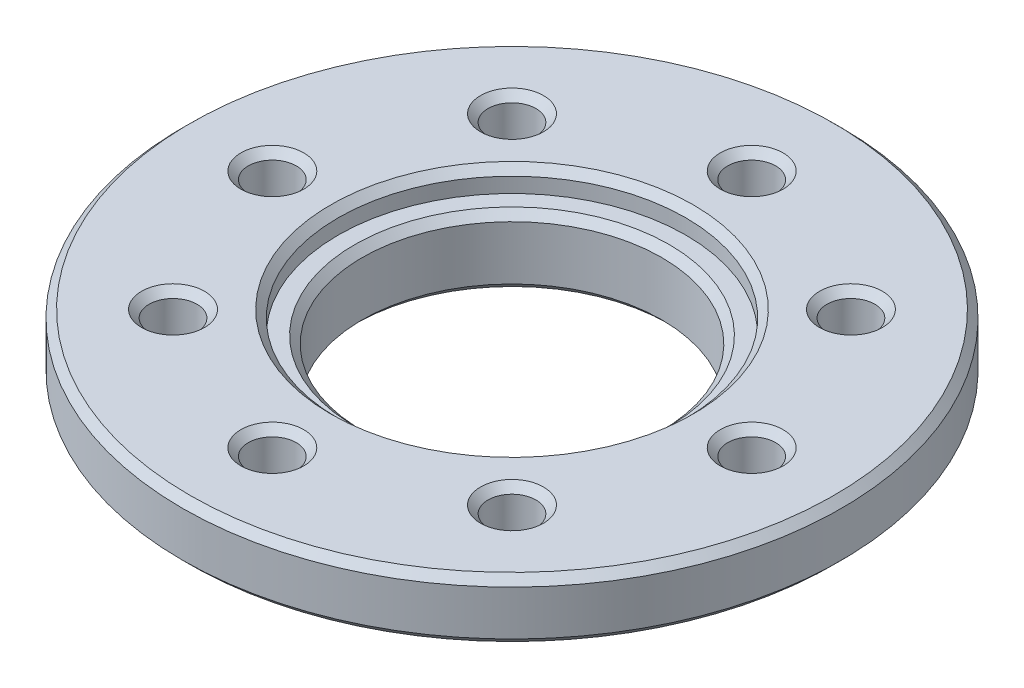
ISO-10303-21;
HEADER;
FILE_DESCRIPTION(('STEP AP214'),'2;1');
FILE_NAME('part.step','',(''),(''),'','','');
FILE_SCHEMA(('AUTOMOTIVE_DESIGN { 1 0 10303 214 1 1 1 1 }'));
ENDSEC;
DATA;
#1=APPLICATION_CONTEXT('core data for automotive mechanical design processes');
#2=APPLICATION_PROTOCOL_DEFINITION('international standard','automotive_design',2000,#1);
#3=PRODUCT_CONTEXT('',#1,'mechanical');
#4=PRODUCT('Part','Part','',(#3));
#5=PRODUCT_RELATED_PRODUCT_CATEGORY('part','',(#4));
#6=PRODUCT_DEFINITION_FORMATION('','',#4);
#7=PRODUCT_DEFINITION_CONTEXT('part definition',#1,'design');
#8=PRODUCT_DEFINITION('design','',#6,#7);
#9=PRODUCT_DEFINITION_SHAPE('','',#8);
#10=(LENGTH_UNIT() NAMED_UNIT(*) SI_UNIT(.MILLI.,.METRE.));
#11=(NAMED_UNIT(*) PLANE_ANGLE_UNIT() SI_UNIT($,.RADIAN.));
#12=(NAMED_UNIT(*) SI_UNIT($,.STERADIAN.) SOLID_ANGLE_UNIT());
#13=UNCERTAINTY_MEASURE_WITH_UNIT(LENGTH_MEASURE(1.E-05),#10,'distance_accuracy_value','');
#14=(GEOMETRIC_REPRESENTATION_CONTEXT(3) GLOBAL_UNCERTAINTY_ASSIGNED_CONTEXT((#13)) GLOBAL_UNIT_ASSIGNED_CONTEXT((#10,
#11,#12)) REPRESENTATION_CONTEXT('',''));
#15=CARTESIAN_POINT('',(0.,0.,0.));
#16=DIRECTION('',(0.,0.,1.));
#17=DIRECTION('',(1.,0.,0.));
#18=AXIS2_PLACEMENT_3D('',#15,#16,#17);
#19=CARTESIAN_POINT('',(0.,-2.,0.));
#20=DIRECTION('',(0.,-1.,0.));
#21=DIRECTION('',(0.,0.,-1.));
#22=AXIS2_PLACEMENT_3D('',#19,#20,#21);
#23=PLANE('',#22);
#24=CARTESIAN_POINT('',(0.,-2.,0.));
#25=DIRECTION('',(0.,-1.,0.));
#26=DIRECTION('',(0.,0.,-1.));
#27=AXIS2_PLACEMENT_3D('',#24,#25,#26);
#28=CIRCLE('',#27,10.7499999999956);
#29=CARTESIAN_POINT('',(0.,-2.,-10.7499999999956));
#30=VERTEX_POINT('',#29);
#31=EDGE_CURVE('E52',#30,#30,#28,.T.);
#32=ORIENTED_EDGE('',*,*,#31,.T.);
#33=EDGE_LOOP('',(#32));
#34=FACE_BOUND('',#33,.T.);
#35=CARTESIAN_POINT('',(0.,-2.,-8.));
#36=DIRECTION('',(0.,-1.,0.));
#37=DIRECTION('',(0.,0.,-1.));
#38=AXIS2_PLACEMENT_3D('',#35,#36,#37);
#39=CIRCLE('',#38,0.799999999999988);
#40=CARTESIAN_POINT('',(0.,-2.,-8.79999999999999));
#41=VERTEX_POINT('',#40);
#42=EDGE_CURVE('E107',#41,#41,#39,.T.);
#43=ORIENTED_EDGE('',*,*,#42,.F.);
#44=EDGE_LOOP('',(#43));
#45=FACE_BOUND('',#44,.T.);
#46=CARTESIAN_POINT('',(5.656854249492,-2.,-5.656854249492));
#47=DIRECTION('',(0.,-1.,0.));
#48=DIRECTION('',(0.,0.,-1.));
#49=AXIS2_PLACEMENT_3D('',#46,#47,#48);
#50=CIRCLE('',#49,0.799999999999988);
#51=CARTESIAN_POINT('',(5.656854249492,-2.,-6.45685424949199));
#52=VERTEX_POINT('',#51);
#53=EDGE_CURVE('E110',#52,#52,#50,.T.);
#54=ORIENTED_EDGE('',*,*,#53,.F.);
#55=EDGE_LOOP('',(#54));
#56=FACE_BOUND('',#55,.T.);
#57=CARTESIAN_POINT('',(8.,-2.,0.));
#58=DIRECTION('',(0.,-1.,0.));
#59=DIRECTION('',(0.,0.,-1.));
#60=AXIS2_PLACEMENT_3D('',#57,#58,#59);
#61=CIRCLE('',#60,0.799999999999988);
#62=CARTESIAN_POINT('',(8.,-2.,-0.799999999999988));
#63=VERTEX_POINT('',#62);
#64=EDGE_CURVE('E129',#63,#63,#61,.T.);
#65=ORIENTED_EDGE('',*,*,#64,.F.);
#66=EDGE_LOOP('',(#65));
#67=FACE_BOUND('',#66,.T.);
#68=CARTESIAN_POINT('',(5.656854249492,-2.,5.656854249492));
#69=DIRECTION('',(0.,-1.,0.));
#70=DIRECTION('',(0.,0.,-1.));
#71=AXIS2_PLACEMENT_3D('',#68,#69,#70);
#72=CIRCLE('',#71,0.799999999999988);
#73=CARTESIAN_POINT('',(5.656854249492,-2.,4.85685424949201));
#74=VERTEX_POINT('',#73);
#75=EDGE_CURVE('E126',#74,#74,#72,.T.);
#76=ORIENTED_EDGE('',*,*,#75,.F.);
#77=EDGE_LOOP('',(#76));
#78=FACE_BOUND('',#77,.T.);
#79=CARTESIAN_POINT('',(0.,-2.,8.));
#80=DIRECTION('',(0.,-1.,0.));
#81=DIRECTION('',(0.,0.,-1.));
#82=AXIS2_PLACEMENT_3D('',#79,#80,#81);
#83=CIRCLE('',#82,0.799999999999988);
#84=CARTESIAN_POINT('',(0.,-2.,7.20000000000001));
#85=VERTEX_POINT('',#84);
#86=EDGE_CURVE('E123',#85,#85,#83,.T.);
#87=ORIENTED_EDGE('',*,*,#86,.F.);
#88=EDGE_LOOP('',(#87));
#89=FACE_BOUND('',#88,.T.);
#90=CARTESIAN_POINT('',(-5.656854249492,-2.,5.656854249492));
#91=DIRECTION('',(0.,-1.,0.));
#92=DIRECTION('',(0.,0.,-1.));
#93=AXIS2_PLACEMENT_3D('',#90,#91,#92);
#94=CIRCLE('',#93,0.799999999999988);
#95=CARTESIAN_POINT('',(-5.656854249492,-2.,4.85685424949201));
#96=VERTEX_POINT('',#95);
#97=EDGE_CURVE('E120',#96,#96,#94,.T.);
#98=ORIENTED_EDGE('',*,*,#97,.F.);
#99=EDGE_LOOP('',(#98));
#100=FACE_BOUND('',#99,.T.);
#101=CARTESIAN_POINT('',(-8.,-2.,0.));
#102=DIRECTION('',(0.,-1.,0.));
#103=DIRECTION('',(0.,0.,-1.));
#104=AXIS2_PLACEMENT_3D('',#101,#102,#103);
#105=CIRCLE('',#104,0.799999999999988);
#106=CARTESIAN_POINT('',(-8.,-2.,-0.799999999999988));
#107=VERTEX_POINT('',#106);
#108=EDGE_CURVE('E117',#107,#107,#105,.T.);
#109=ORIENTED_EDGE('',*,*,#108,.F.);
#110=EDGE_LOOP('',(#109));
#111=FACE_BOUND('',#110,.T.);
#112=CARTESIAN_POINT('',(-5.656854249492,-2.,-5.656854249492));
#113=DIRECTION('',(0.,-1.,0.));
#114=DIRECTION('',(0.,0.,-1.));
#115=AXIS2_PLACEMENT_3D('',#112,#113,#114);
#116=CIRCLE('',#115,0.799999999999988);
#117=CARTESIAN_POINT('',(-5.656854249492,-2.,-6.45685424949199));
#118=VERTEX_POINT('',#117);
#119=EDGE_CURVE('E114',#118,#118,#116,.T.);
#120=ORIENTED_EDGE('',*,*,#119,.F.);
#121=EDGE_LOOP('',(#120));
#122=FACE_BOUND('',#121,.T.);
#123=CARTESIAN_POINT('',(0.,-2.,0.));
#124=DIRECTION('',(0.,-1.,0.));
#125=DIRECTION('',(0.,0.,-1.));
#126=AXIS2_PLACEMENT_3D('',#123,#124,#125);
#127=CIRCLE('',#126,6.25);
#128=CARTESIAN_POINT('',(0.,-2.,-6.25));
#129=VERTEX_POINT('',#128);
#130=EDGE_CURVE('E106',#129,#129,#127,.T.);
#131=ORIENTED_EDGE('',*,*,#130,.F.);
#132=EDGE_LOOP('',(#131));
#133=FACE_BOUND('',#132,.T.);
#134=ADVANCED_FACE('F14',(#34,#45,#56,#67,#78,#89,#100,#111,#122,#133),#23,.T.);
#135=CARTESIAN_POINT('',(0.,0.,0.));
#136=DIRECTION('',(0.,-1.,0.));
#137=DIRECTION('',(0.,0.,-1.));
#138=AXIS2_PLACEMENT_3D('',#135,#136,#137);
#139=CYLINDRICAL_SURFACE('',#138,11.);
#140=CARTESIAN_POINT('',(0.,-1.75000000005246,0.));
#141=DIRECTION('',(0.,-1.,0.));
#142=DIRECTION('',(0.,0.,-1.));
#143=AXIS2_PLACEMENT_3D('',#140,#141,#142);
#144=CIRCLE('',#143,11.);
#145=CARTESIAN_POINT('',(0.,-1.75000000005246,-11.));
#146=VERTEX_POINT('',#145);
#147=EDGE_CURVE('E46',#146,#146,#144,.F.);
#148=ORIENTED_EDGE('',*,*,#147,.T.);
#149=EDGE_LOOP('',(#148));
#150=FACE_BOUND('',#149,.T.);
#151=CARTESIAN_POINT('',(0.,-0.250000000004393,0.));
#152=DIRECTION('',(0.,1.,0.));
#153=DIRECTION('',(0.,0.,1.));
#154=AXIS2_PLACEMENT_3D('',#151,#152,#153);
#155=CIRCLE('',#154,11.);
#156=CARTESIAN_POINT('',(0.,-0.250000000004393,11.));
#157=VERTEX_POINT('',#156);
#158=EDGE_CURVE('E49',#157,#157,#155,.F.);
#159=ORIENTED_EDGE('',*,*,#158,.T.);
#160=EDGE_LOOP('',(#159));
#161=FACE_BOUND('',#160,.T.);
#162=ADVANCED_FACE('F155',(#150,#161),#139,.T.);
#163=CARTESIAN_POINT('',(11.,0.,0.));
#164=DIRECTION('',(0.,1.,0.));
#165=DIRECTION('',(0.,0.,1.));
#166=AXIS2_PLACEMENT_3D('',#163,#164,#165);
#167=PLANE('',#166);
#168=CARTESIAN_POINT('',(8.,0.,0.));
#169=DIRECTION('',(0.,1.,0.));
#170=DIRECTION('',(0.,0.,1.));
#171=AXIS2_PLACEMENT_3D('',#168,#169,#170);
#172=CIRCLE('',#171,1.04999999994754);
#173=CARTESIAN_POINT('',(8.,0.,1.04999999994754));
#174=VERTEX_POINT('',#173);
#175=EDGE_CURVE('E73',#174,#174,#172,.F.);
#176=ORIENTED_EDGE('',*,*,#175,.T.);
#177=EDGE_LOOP('',(#176));
#178=FACE_BOUND('',#177,.T.);
#179=CARTESIAN_POINT('',(-8.,0.,0.));
#180=DIRECTION('',(0.,1.,0.));
#181=DIRECTION('',(0.,0.,1.));
#182=AXIS2_PLACEMENT_3D('',#179,#180,#181);
#183=CIRCLE('',#182,1.04999999994754);
#184=CARTESIAN_POINT('',(-8.,0.,1.04999999994754));
#185=VERTEX_POINT('',#184);
#186=EDGE_CURVE('E76',#185,#185,#183,.F.);
#187=ORIENTED_EDGE('',*,*,#186,.T.);
#188=EDGE_LOOP('',(#187));
#189=FACE_BOUND('',#188,.T.);
#190=CARTESIAN_POINT('',(0.,0.,8.));
#191=DIRECTION('',(0.,1.,0.));
#192=DIRECTION('',(0.,0.,1.));
#193=AXIS2_PLACEMENT_3D('',#190,#191,#192);
#194=CIRCLE('',#193,1.04999999994754);
#195=CARTESIAN_POINT('',(0.,0.,9.04999999994754));
#196=VERTEX_POINT('',#195);
#197=EDGE_CURVE('E79',#196,#196,#194,.F.);
#198=ORIENTED_EDGE('',*,*,#197,.T.);
#199=EDGE_LOOP('',(#198));
#200=FACE_BOUND('',#199,.T.);
#201=CARTESIAN_POINT('',(0.,0.,0.));
#202=DIRECTION('',(0.,1.,0.));
#203=DIRECTION('',(0.,0.,1.));
#204=AXIS2_PLACEMENT_3D('',#201,#202,#203);
#205=CIRCLE('',#204,6.04999999994754);
#206=CARTESIAN_POINT('',(0.,0.,6.04999999994754));
#207=VERTEX_POINT('',#206);
#208=EDGE_CURVE('E82',#207,#207,#205,.F.);
#209=ORIENTED_EDGE('',*,*,#208,.T.);
#210=EDGE_LOOP('',(#209));
#211=FACE_BOUND('',#210,.T.);
#212=CARTESIAN_POINT('',(5.656854249492,0.,5.656854249492));
#213=DIRECTION('',(0.,1.,0.));
#214=DIRECTION('',(0.,0.,1.));
#215=AXIS2_PLACEMENT_3D('',#212,#213,#214);
#216=CIRCLE('',#215,1.04999999994754);
#217=CARTESIAN_POINT('',(5.656854249492,0.,6.70685424943954));
#218=VERTEX_POINT('',#217);
#219=EDGE_CURVE('E85',#218,#218,#216,.F.);
#220=ORIENTED_EDGE('',*,*,#219,.T.);
#221=EDGE_LOOP('',(#220));
#222=FACE_BOUND('',#221,.T.);
#223=CARTESIAN_POINT('',(0.,0.,0.));
#224=DIRECTION('',(0.,1.,0.));
#225=DIRECTION('',(0.,0.,1.));
#226=AXIS2_PLACEMENT_3D('',#223,#224,#225);
#227=CIRCLE('',#226,10.7500000000524);
#228=CARTESIAN_POINT('',(0.,0.,10.7500000000524));
#229=VERTEX_POINT('',#228);
#230=EDGE_CURVE('E88',#229,#229,#227,.T.);
#231=ORIENTED_EDGE('',*,*,#230,.T.);
#232=EDGE_LOOP('',(#231));
#233=FACE_BOUND('',#232,.T.);
#234=CARTESIAN_POINT('',(-5.656854249492,0.,5.656854249492));
#235=DIRECTION('',(0.,1.,0.));
#236=DIRECTION('',(0.,0.,1.));
#237=AXIS2_PLACEMENT_3D('',#234,#235,#236);
#238=CIRCLE('',#237,1.04999999994754);
#239=CARTESIAN_POINT('',(-5.656854249492,0.,6.70685424943954));
#240=VERTEX_POINT('',#239);
#241=EDGE_CURVE('E91',#240,#240,#238,.F.);
#242=ORIENTED_EDGE('',*,*,#241,.T.);
#243=EDGE_LOOP('',(#242));
#244=FACE_BOUND('',#243,.T.);
#245=CARTESIAN_POINT('',(-5.656854249492,0.,-5.656854249492));
#246=DIRECTION('',(0.,1.,0.));
#247=DIRECTION('',(0.,0.,1.));
#248=AXIS2_PLACEMENT_3D('',#245,#246,#247);
#249=CIRCLE('',#248,1.04999999994754);
#250=CARTESIAN_POINT('',(-5.656854249492,0.,-4.60685424954446));
#251=VERTEX_POINT('',#250);
#252=EDGE_CURVE('E94',#251,#251,#249,.F.);
#253=ORIENTED_EDGE('',*,*,#252,.T.);
#254=EDGE_LOOP('',(#253));
#255=FACE_BOUND('',#254,.T.);
#256=CARTESIAN_POINT('',(0.,0.,-8.));
#257=DIRECTION('',(0.,1.,0.));
#258=DIRECTION('',(0.,0.,1.));
#259=AXIS2_PLACEMENT_3D('',#256,#257,#258);
#260=CIRCLE('',#259,1.04999999994754);
#261=CARTESIAN_POINT('',(0.,0.,-6.95000000005246));
#262=VERTEX_POINT('',#261);
#263=EDGE_CURVE('E97',#262,#262,#260,.F.);
#264=ORIENTED_EDGE('',*,*,#263,.T.);
#265=EDGE_LOOP('',(#264));
#266=FACE_BOUND('',#265,.T.);
#267=CARTESIAN_POINT('',(5.656854249492,0.,-5.656854249492));
#268=DIRECTION('',(0.,1.,0.));
#269=DIRECTION('',(0.,0.,1.));
#270=AXIS2_PLACEMENT_3D('',#267,#268,#269);
#271=CIRCLE('',#270,1.04999999994754);
#272=CARTESIAN_POINT('',(5.656854249492,0.,-4.60685424954446));
#273=VERTEX_POINT('',#272);
#274=EDGE_CURVE('E100',#273,#273,#271,.F.);
#275=ORIENTED_EDGE('',*,*,#274,.T.);
#276=EDGE_LOOP('',(#275));
#277=FACE_BOUND('',#276,.T.);
#278=ADVANCED_FACE('F161',(#178,#189,#200,#211,#222,#233,#244,#255,#266,#277),#167,.T.);
#279=CARTESIAN_POINT('',(0.,-3.05,0.));
#280=DIRECTION('',(0.,1.,0.));
#281=DIRECTION('',(0.,0.,1.));
#282=AXIS2_PLACEMENT_3D('',#279,#280,#281);
#283=CYLINDRICAL_SURFACE('',#282,6.25);
#284=CARTESIAN_POINT('',(0.,-2.80000000005244,0.));
#285=DIRECTION('',(0.,-1.,0.));
#286=DIRECTION('',(0.,0.,-1.));
#287=AXIS2_PLACEMENT_3D('',#284,#285,#286);
#288=CIRCLE('',#287,6.25);
#289=CARTESIAN_POINT('',(0.,-2.80000000005244,-6.25));
#290=VERTEX_POINT('',#289);
#291=EDGE_CURVE('E34',#290,#290,#288,.F.);
#292=ORIENTED_EDGE('',*,*,#291,.T.);
#293=EDGE_LOOP('',(#292));
#294=FACE_BOUND('',#293,.T.);
#295=ORIENTED_EDGE('',*,*,#130,.T.);
#296=EDGE_LOOP('',(#295));
#297=FACE_BOUND('',#296,.T.);
#298=ADVANCED_FACE('F167',(#294,#297),#283,.T.);
#299=CARTESIAN_POINT('',(0.,-3.05,0.));
#300=DIRECTION('',(0.,-1.,0.));
#301=DIRECTION('',(0.,0.,-1.));
#302=AXIS2_PLACEMENT_3D('',#299,#300,#301);
#303=PLANE('',#302);
#304=CARTESIAN_POINT('',(0.,-3.05,0.));
#305=DIRECTION('',(0.,-1.,0.));
#306=DIRECTION('',(0.,0.,-1.));
#307=AXIS2_PLACEMENT_3D('',#304,#305,#306);
#308=CIRCLE('',#307,5.25000000000441);
#309=CARTESIAN_POINT('',(0.,-3.05,-5.25000000000441));
#310=VERTEX_POINT('',#309);
#311=EDGE_CURVE('E61',#310,#310,#308,.F.);
#312=ORIENTED_EDGE('',*,*,#311,.T.);
#313=EDGE_LOOP('',(#312));
#314=FACE_BOUND('',#313,.T.);
#315=CARTESIAN_POINT('',(0.,-3.05,0.));
#316=DIRECTION('',(0.,-1.,0.));
#317=DIRECTION('',(0.,0.,-1.));
#318=AXIS2_PLACEMENT_3D('',#315,#316,#317);
#319=CIRCLE('',#318,5.9999999999956);
#320=CARTESIAN_POINT('',(0.,-3.05,-5.9999999999956));
#321=VERTEX_POINT('',#320);
#322=EDGE_CURVE('E64',#321,#321,#319,.T.);
#323=ORIENTED_EDGE('',*,*,#322,.T.);
#324=EDGE_LOOP('',(#323));
#325=FACE_BOUND('',#324,.T.);
#326=ADVANCED_FACE('F259',(#314,#325),#303,.T.);
#327=CARTESIAN_POINT('',(-5.656854249492,0.,-5.656854249492));
#328=DIRECTION('',(0.,1.,0.));
#329=DIRECTION('',(0.,0.,1.));
#330=AXIS2_PLACEMENT_3D('',#327,#328,#329);
#331=CYLINDRICAL_SURFACE('',#330,0.799999999999988);
#332=CARTESIAN_POINT('',(-5.656854249492,-0.250000000004392,-5.656854249492));
#333=DIRECTION('',(0.,1.,0.));
#334=DIRECTION('',(0.,0.,1.));
#335=AXIS2_PLACEMENT_3D('',#332,#333,#334);
#336=CIRCLE('',#335,0.799999999999988);
#337=CARTESIAN_POINT('',(-5.656854249492,-0.250000000004392,-4.85685424949201));
#338=VERTEX_POINT('',#337);
#339=EDGE_CURVE('E29',#338,#338,#336,.T.);
#340=ORIENTED_EDGE('',*,*,#339,.T.);
#341=EDGE_LOOP('',(#340));
#342=FACE_BOUND('',#341,.T.);
#343=ORIENTED_EDGE('',*,*,#119,.T.);
#344=EDGE_LOOP('',(#343));
#345=FACE_BOUND('',#344,.T.);
#346=ADVANCED_FACE('F256',(#342,#345),#331,.F.);
#347=CARTESIAN_POINT('',(-8.,0.,0.));
#348=DIRECTION('',(0.,1.,0.));
#349=DIRECTION('',(0.,0.,1.));
#350=AXIS2_PLACEMENT_3D('',#347,#348,#349);
#351=CYLINDRICAL_SURFACE('',#350,0.799999999999988);
#352=CARTESIAN_POINT('',(-8.,-0.250000000004392,0.));
#353=DIRECTION('',(0.,1.,0.));
#354=DIRECTION('',(0.,0.,1.));
#355=AXIS2_PLACEMENT_3D('',#352,#353,#354);
#356=CIRCLE('',#355,0.799999999999988);
#357=CARTESIAN_POINT('',(-8.,-0.250000000004392,0.799999999999988));
#358=VERTEX_POINT('',#357);
#359=EDGE_CURVE('E70',#358,#358,#356,.T.);
#360=ORIENTED_EDGE('',*,*,#359,.T.);
#361=EDGE_LOOP('',(#360));
#362=FACE_BOUND('',#361,.T.);
#363=ORIENTED_EDGE('',*,*,#108,.T.);
#364=EDGE_LOOP('',(#363));
#365=FACE_BOUND('',#364,.T.);
#366=ADVANCED_FACE('F252',(#362,#365),#351,.F.);
#367=CARTESIAN_POINT('',(-5.656854249492,0.,5.656854249492));
#368=DIRECTION('',(0.,1.,0.));
#369=DIRECTION('',(0.,0.,1.));
#370=AXIS2_PLACEMENT_3D('',#367,#368,#369);
#371=CYLINDRICAL_SURFACE('',#370,0.799999999999988);
#372=CARTESIAN_POINT('',(-5.656854249492,-0.250000000004392,5.656854249492));
#373=DIRECTION('',(0.,1.,0.));
#374=DIRECTION('',(0.,0.,1.));
#375=AXIS2_PLACEMENT_3D('',#372,#373,#374);
#376=CIRCLE('',#375,0.799999999999988);
#377=CARTESIAN_POINT('',(-5.656854249492,-0.250000000004392,6.45685424949199));
#378=VERTEX_POINT('',#377);
#379=EDGE_CURVE('E37',#378,#378,#376,.T.);
#380=ORIENTED_EDGE('',*,*,#379,.T.);
#381=EDGE_LOOP('',(#380));
#382=FACE_BOUND('',#381,.T.);
#383=ORIENTED_EDGE('',*,*,#97,.T.);
#384=EDGE_LOOP('',(#383));
#385=FACE_BOUND('',#384,.T.);
#386=ADVANCED_FACE('F248',(#382,#385),#371,.F.);
#387=CARTESIAN_POINT('',(0.,0.,8.));
#388=DIRECTION('',(0.,1.,0.));
#389=DIRECTION('',(0.,0.,1.));
#390=AXIS2_PLACEMENT_3D('',#387,#388,#389);
#391=CYLINDRICAL_SURFACE('',#390,0.799999999999988);
#392=CARTESIAN_POINT('',(0.,-0.250000000004392,8.));
#393=DIRECTION('',(0.,1.,0.));
#394=DIRECTION('',(0.,0.,1.));
#395=AXIS2_PLACEMENT_3D('',#392,#393,#394);
#396=CIRCLE('',#395,0.799999999999988);
#397=CARTESIAN_POINT('',(0.,-0.250000000004392,8.79999999999999));
#398=VERTEX_POINT('',#397);
#399=EDGE_CURVE('E67',#398,#398,#396,.T.);
#400=ORIENTED_EDGE('',*,*,#399,.T.);
#401=EDGE_LOOP('',(#400));
#402=FACE_BOUND('',#401,.T.);
#403=ORIENTED_EDGE('',*,*,#86,.T.);
#404=EDGE_LOOP('',(#403));
#405=FACE_BOUND('',#404,.T.);
#406=ADVANCED_FACE('F244',(#402,#405),#391,.F.);
#407=CARTESIAN_POINT('',(5.656854249492,0.,5.656854249492));
#408=DIRECTION('',(0.,1.,0.));
#409=DIRECTION('',(0.,0.,1.));
#410=AXIS2_PLACEMENT_3D('',#407,#408,#409);
#411=CYLINDRICAL_SURFACE('',#410,0.799999999999988);
#412=CARTESIAN_POINT('',(5.656854249492,-0.250000000004392,5.656854249492));
#413=DIRECTION('',(0.,1.,0.));
#414=DIRECTION('',(0.,0.,1.));
#415=AXIS2_PLACEMENT_3D('',#412,#413,#414);
#416=CIRCLE('',#415,0.799999999999988);
#417=CARTESIAN_POINT('',(5.656854249492,-0.250000000004392,6.45685424949199));
#418=VERTEX_POINT('',#417);
#419=EDGE_CURVE('E40',#418,#418,#416,.T.);
#420=ORIENTED_EDGE('',*,*,#419,.T.);
#421=EDGE_LOOP('',(#420));
#422=FACE_BOUND('',#421,.T.);
#423=ORIENTED_EDGE('',*,*,#75,.T.);
#424=EDGE_LOOP('',(#423));
#425=FACE_BOUND('',#424,.T.);
#426=ADVANCED_FACE('F240',(#422,#425),#411,.F.);
#427=CARTESIAN_POINT('',(8.,0.,0.));
#428=DIRECTION('',(0.,1.,0.));
#429=DIRECTION('',(0.,0.,1.));
#430=AXIS2_PLACEMENT_3D('',#427,#428,#429);
#431=CYLINDRICAL_SURFACE('',#430,0.799999999999988);
#432=CARTESIAN_POINT('',(8.,-0.250000000004392,0.));
#433=DIRECTION('',(0.,1.,0.));
#434=DIRECTION('',(0.,0.,1.));
#435=AXIS2_PLACEMENT_3D('',#432,#433,#434);
#436=CIRCLE('',#435,0.799999999999988);
#437=CARTESIAN_POINT('',(8.,-0.250000000004392,0.799999999999988));
#438=VERTEX_POINT('',#437);
#439=EDGE_CURVE('E103',#438,#438,#436,.T.);
#440=ORIENTED_EDGE('',*,*,#439,.T.);
#441=EDGE_LOOP('',(#440));
#442=FACE_BOUND('',#441,.T.);
#443=ORIENTED_EDGE('',*,*,#64,.T.);
#444=EDGE_LOOP('',(#443));
#445=FACE_BOUND('',#444,.T.);
#446=ADVANCED_FACE('F237',(#442,#445),#431,.F.);
#447=CARTESIAN_POINT('',(5.656854249492,0.,-5.656854249492));
#448=DIRECTION('',(0.,1.,0.));
#449=DIRECTION('',(0.,0.,1.));
#450=AXIS2_PLACEMENT_3D('',#447,#448,#449);
#451=CYLINDRICAL_SURFACE('',#450,0.799999999999988);
#452=CARTESIAN_POINT('',(5.656854249492,-0.250000000004392,-5.656854249492));
#453=DIRECTION('',(0.,1.,0.));
#454=DIRECTION('',(0.,0.,1.));
#455=AXIS2_PLACEMENT_3D('',#452,#453,#454);
#456=CIRCLE('',#455,0.799999999999988);
#457=CARTESIAN_POINT('',(5.656854249492,-0.250000000004392,-4.85685424949201));
#458=VERTEX_POINT('',#457);
#459=EDGE_CURVE('E10',#458,#458,#456,.T.);
#460=ORIENTED_EDGE('',*,*,#459,.T.);
#461=EDGE_LOOP('',(#460));
#462=FACE_BOUND('',#461,.T.);
#463=ORIENTED_EDGE('',*,*,#53,.T.);
#464=EDGE_LOOP('',(#463));
#465=FACE_BOUND('',#464,.T.);
#466=ADVANCED_FACE('F231',(#462,#465),#451,.F.);
#467=CARTESIAN_POINT('',(0.,0.,-8.));
#468=DIRECTION('',(0.,1.,0.));
#469=DIRECTION('',(0.,0.,1.));
#470=AXIS2_PLACEMENT_3D('',#467,#468,#469);
#471=CYLINDRICAL_SURFACE('',#470,0.799999999999988);
#472=CARTESIAN_POINT('',(0.,-0.250000000004392,-8.));
#473=DIRECTION('',(0.,1.,0.));
#474=DIRECTION('',(0.,0.,1.));
#475=AXIS2_PLACEMENT_3D('',#472,#473,#474);
#476=CIRCLE('',#475,0.799999999999988);
#477=CARTESIAN_POINT('',(0.,-0.250000000004392,-7.20000000000001));
#478=VERTEX_POINT('',#477);
#479=EDGE_CURVE('E25',#478,#478,#476,.T.);
#480=ORIENTED_EDGE('',*,*,#479,.T.);
#481=EDGE_LOOP('',(#480));
#482=FACE_BOUND('',#481,.T.);
#483=ORIENTED_EDGE('',*,*,#42,.T.);
#484=EDGE_LOOP('',(#483));
#485=FACE_BOUND('',#484,.T.);
#486=ADVANCED_FACE('F225',(#482,#485),#471,.F.);
#487=CARTESIAN_POINT('',(0.,0.,0.));
#488=DIRECTION('',(0.,1.,0.));
#489=DIRECTION('',(0.,0.,1.));
#490=AXIS2_PLACEMENT_3D('',#487,#488,#489);
#491=CYLINDRICAL_SURFACE('',#490,5.00000000000001);
#492=CARTESIAN_POINT('',(0.,-2.80000000005244,0.));
#493=DIRECTION('',(0.,-1.,0.));
#494=DIRECTION('',(0.,0.,-1.));
#495=AXIS2_PLACEMENT_3D('',#492,#493,#494);
#496=CIRCLE('',#495,5.00000000000001);
#497=CARTESIAN_POINT('',(0.,-2.80000000005244,-5.00000000000001));
#498=VERTEX_POINT('',#497);
#499=EDGE_CURVE('E55',#498,#498,#496,.T.);
#500=ORIENTED_EDGE('',*,*,#499,.T.);
#501=EDGE_LOOP('',(#500));
#502=FACE_BOUND('',#501,.T.);
#503=CARTESIAN_POINT('',(0.,-1.00000000000439,0.));
#504=DIRECTION('',(0.,-1.,0.));
#505=DIRECTION('',(0.,0.,-1.));
#506=AXIS2_PLACEMENT_3D('',#503,#504,#505);
#507=CIRCLE('',#506,5.00000000000001);
#508=CARTESIAN_POINT('',(0.,-1.00000000000439,-5.00000000000001));
#509=VERTEX_POINT('',#508);
#510=EDGE_CURVE('E58',#509,#509,#507,.F.);
#511=ORIENTED_EDGE('',*,*,#510,.T.);
#512=EDGE_LOOP('',(#511));
#513=FACE_BOUND('',#512,.T.);
#514=ADVANCED_FACE('F152',(#502,#513),#491,.F.);
#515=CARTESIAN_POINT('',(5.00000000000001,-0.750000000000001,0.));
#516=DIRECTION('',(0.,-1.,0.));
#517=DIRECTION('',(0.,0.,-1.));
#518=AXIS2_PLACEMENT_3D('',#515,#516,#517);
#519=PLANE('',#518);
#520=CARTESIAN_POINT('',(0.,-0.750000000000001,0.));
#521=DIRECTION('',(0.,-1.,0.));
#522=DIRECTION('',(0.,0.,-1.));
#523=AXIS2_PLACEMENT_3D('',#520,#521,#522);
#524=CIRCLE('',#523,5.24999999994756);
#525=CARTESIAN_POINT('',(0.,-0.750000000000001,-5.24999999994756));
#526=VERTEX_POINT('',#525);
#527=EDGE_CURVE('E21',#526,#526,#524,.T.);
#528=ORIENTED_EDGE('',*,*,#527,.T.);
#529=EDGE_LOOP('',(#528));
#530=FACE_BOUND('',#529,.T.);
#531=CARTESIAN_POINT('',(0.,-0.750000000000001,0.));
#532=DIRECTION('',(0.,1.,0.));
#533=DIRECTION('',(0.,0.,1.));
#534=AXIS2_PLACEMENT_3D('',#531,#532,#533);
#535=CIRCLE('',#534,5.8);
#536=CARTESIAN_POINT('',(0.,-0.750000000000001,5.8));
#537=VERTEX_POINT('',#536);
#538=EDGE_CURVE('E111',#537,#537,#535,.T.);
#539=ORIENTED_EDGE('',*,*,#538,.T.);
#540=EDGE_LOOP('',(#539));
#541=FACE_BOUND('',#540,.T.);
#542=ADVANCED_FACE('F137',(#530,#541),#519,.F.);
#543=CARTESIAN_POINT('',(0.,0.,0.));
#544=DIRECTION('',(0.,1.,0.));
#545=DIRECTION('',(0.,0.,1.));
#546=AXIS2_PLACEMENT_3D('',#543,#544,#545);
#547=CYLINDRICAL_SURFACE('',#546,5.8);
#548=CARTESIAN_POINT('',(0.,-0.250000000004392,0.));
#549=DIRECTION('',(0.,1.,0.));
#550=DIRECTION('',(0.,0.,1.));
#551=AXIS2_PLACEMENT_3D('',#548,#549,#550);
#552=CIRCLE('',#551,5.8);
#553=CARTESIAN_POINT('',(0.,-0.250000000004392,5.8));
#554=VERTEX_POINT('',#553);
#555=EDGE_CURVE('E43',#554,#554,#552,.T.);
#556=ORIENTED_EDGE('',*,*,#555,.T.);
#557=EDGE_LOOP('',(#556));
#558=FACE_BOUND('',#557,.T.);
#559=ORIENTED_EDGE('',*,*,#538,.F.);
#560=EDGE_LOOP('',(#559));
#561=FACE_BOUND('',#560,.T.);
#562=ADVANCED_FACE('F139',(#558,#561),#547,.F.);
#563=CARTESIAN_POINT('',(8.,-0.250000000004392,0.));
#564=DIRECTION('',(0.,1.,0.));
#565=DIRECTION('',(0.,0.,1.));
#566=AXIS2_PLACEMENT_3D('',#563,#564,#565);
#567=CONICAL_SURFACE('',#566,0.799999999999988,0.785398163283763);
#568=ORIENTED_EDGE('',*,*,#175,.F.);
#569=EDGE_LOOP('',(#568));
#570=FACE_BOUND('',#569,.T.);
#571=ORIENTED_EDGE('',*,*,#439,.F.);
#572=EDGE_LOOP('',(#571));
#573=FACE_BOUND('',#572,.T.);
#574=ADVANCED_FACE('F141',(#570,#573),#567,.F.);
#575=CARTESIAN_POINT('',(-8.,-0.250000000004392,0.));
#576=DIRECTION('',(0.,1.,0.));
#577=DIRECTION('',(0.,0.,1.));
#578=AXIS2_PLACEMENT_3D('',#575,#576,#577);
#579=CONICAL_SURFACE('',#578,0.799999999999988,0.785398163283763);
#580=ORIENTED_EDGE('',*,*,#186,.F.);
#581=EDGE_LOOP('',(#580));
#582=FACE_BOUND('',#581,.T.);
#583=ORIENTED_EDGE('',*,*,#359,.F.);
#584=EDGE_LOOP('',(#583));
#585=FACE_BOUND('',#584,.T.);
#586=ADVANCED_FACE('F149',(#582,#585),#579,.F.);
#587=CARTESIAN_POINT('',(0.,-0.250000000004392,8.));
#588=DIRECTION('',(0.,1.,0.));
#589=DIRECTION('',(0.,0.,1.));
#590=AXIS2_PLACEMENT_3D('',#587,#588,#589);
#591=CONICAL_SURFACE('',#590,0.799999999999988,0.785398163283763);
#592=ORIENTED_EDGE('',*,*,#197,.F.);
#593=EDGE_LOOP('',(#592));
#594=FACE_BOUND('',#593,.T.);
#595=ORIENTED_EDGE('',*,*,#399,.F.);
#596=EDGE_LOOP('',(#595));
#597=FACE_BOUND('',#596,.T.);
#598=ADVANCED_FACE('F174',(#594,#597),#591,.F.);
#599=CARTESIAN_POINT('',(0.,-3.05,0.));
#600=DIRECTION('',(0.,-1.,0.));
#601=DIRECTION('',(0.,0.,-1.));
#602=AXIS2_PLACEMENT_3D('',#599,#600,#601);
#603=CONICAL_SURFACE('',#602,5.25000000000441,0.785398163511128);
#604=ORIENTED_EDGE('',*,*,#499,.F.);
#605=EDGE_LOOP('',(#604));
#606=FACE_BOUND('',#605,.T.);
#607=ORIENTED_EDGE('',*,*,#311,.F.);
#608=EDGE_LOOP('',(#607));
#609=FACE_BOUND('',#608,.T.);
#610=ADVANCED_FACE('F178',(#606,#609),#603,.F.);
#611=CARTESIAN_POINT('',(0.,-2.,0.));
#612=DIRECTION('',(0.,1.,0.));
#613=DIRECTION('',(0.,0.,1.));
#614=AXIS2_PLACEMENT_3D('',#611,#612,#613);
#615=CONICAL_SURFACE('',#614,10.7499999999956,0.785398163511132);
#616=ORIENTED_EDGE('',*,*,#147,.F.);
#617=EDGE_LOOP('',(#616));
#618=FACE_BOUND('',#617,.T.);
#619=ORIENTED_EDGE('',*,*,#31,.F.);
#620=EDGE_LOOP('',(#619));
#621=FACE_BOUND('',#620,.T.);
#622=ADVANCED_FACE('F182',(#618,#621),#615,.T.);
#623=CARTESIAN_POINT('',(0.,-0.250000000004392,0.));
#624=DIRECTION('',(0.,1.,0.));
#625=DIRECTION('',(0.,0.,1.));
#626=AXIS2_PLACEMENT_3D('',#623,#624,#625);
#627=CONICAL_SURFACE('',#626,5.8,0.785398163283763);
#628=ORIENTED_EDGE('',*,*,#208,.F.);
#629=EDGE_LOOP('',(#628));
#630=FACE_BOUND('',#629,.T.);
#631=ORIENTED_EDGE('',*,*,#555,.F.);
#632=EDGE_LOOP('',(#631));
#633=FACE_BOUND('',#632,.T.);
#634=ADVANCED_FACE('F186',(#630,#633),#627,.F.);
#635=CARTESIAN_POINT('',(5.656854249492,-0.250000000004392,5.656854249492));
#636=DIRECTION('',(0.,1.,0.));
#637=DIRECTION('',(0.,0.,1.));
#638=AXIS2_PLACEMENT_3D('',#635,#636,#637);
#639=CONICAL_SURFACE('',#638,0.799999999999988,0.785398163283761);
#640=ORIENTED_EDGE('',*,*,#219,.F.);
#641=EDGE_LOOP('',(#640));
#642=FACE_BOUND('',#641,.T.);
#643=ORIENTED_EDGE('',*,*,#419,.F.);
#644=EDGE_LOOP('',(#643));
#645=FACE_BOUND('',#644,.T.);
#646=ADVANCED_FACE('F190',(#642,#645),#639,.F.);
#647=CARTESIAN_POINT('',(0.,-0.250000000004393,0.));
#648=DIRECTION('',(0.,-1.,0.));
#649=DIRECTION('',(0.,0.,-1.));
#650=AXIS2_PLACEMENT_3D('',#647,#648,#649);
#651=CONICAL_SURFACE('',#650,11.,0.785398163283772);
#652=ORIENTED_EDGE('',*,*,#230,.F.);
#653=EDGE_LOOP('',(#652));
#654=FACE_BOUND('',#653,.T.);
#655=ORIENTED_EDGE('',*,*,#158,.F.);
#656=EDGE_LOOP('',(#655));
#657=FACE_BOUND('',#656,.T.);
#658=ADVANCED_FACE('F194',(#654,#657),#651,.T.);
#659=CARTESIAN_POINT('',(-5.656854249492,-0.250000000004392,5.656854249492));
#660=DIRECTION('',(0.,1.,0.));
#661=DIRECTION('',(0.,0.,1.));
#662=AXIS2_PLACEMENT_3D('',#659,#660,#661);
#663=CONICAL_SURFACE('',#662,0.799999999999988,0.785398163283761);
#664=ORIENTED_EDGE('',*,*,#241,.F.);
#665=EDGE_LOOP('',(#664));
#666=FACE_BOUND('',#665,.T.);
#667=ORIENTED_EDGE('',*,*,#379,.F.);
#668=EDGE_LOOP('',(#667));
#669=FACE_BOUND('',#668,.T.);
#670=ADVANCED_FACE('F198',(#666,#669),#663,.F.);
#671=CARTESIAN_POINT('',(0.,-3.05,0.));
#672=DIRECTION('',(0.,1.,0.));
#673=DIRECTION('',(0.,0.,1.));
#674=AXIS2_PLACEMENT_3D('',#671,#672,#673);
#675=CONICAL_SURFACE('',#674,5.9999999999956,0.785398163511133);
#676=ORIENTED_EDGE('',*,*,#291,.F.);
#677=EDGE_LOOP('',(#676));
#678=FACE_BOUND('',#677,.T.);
#679=ORIENTED_EDGE('',*,*,#322,.F.);
#680=EDGE_LOOP('',(#679));
#681=FACE_BOUND('',#680,.T.);
#682=ADVANCED_FACE('F202',(#678,#681),#675,.T.);
#683=CARTESIAN_POINT('',(-5.656854249492,-0.250000000004392,-5.656854249492));
#684=DIRECTION('',(0.,1.,0.));
#685=DIRECTION('',(0.,0.,1.));
#686=AXIS2_PLACEMENT_3D('',#683,#684,#685);
#687=CONICAL_SURFACE('',#686,0.799999999999988,0.785398163283761);
#688=ORIENTED_EDGE('',*,*,#252,.F.);
#689=EDGE_LOOP('',(#688));
#690=FACE_BOUND('',#689,.T.);
#691=ORIENTED_EDGE('',*,*,#339,.F.);
#692=EDGE_LOOP('',(#691));
#693=FACE_BOUND('',#692,.T.);
#694=ADVANCED_FACE('F206',(#690,#693),#687,.F.);
#695=CARTESIAN_POINT('',(0.,-0.250000000004392,-8.));
#696=DIRECTION('',(0.,1.,0.));
#697=DIRECTION('',(0.,0.,1.));
#698=AXIS2_PLACEMENT_3D('',#695,#696,#697);
#699=CONICAL_SURFACE('',#698,0.799999999999988,0.785398163283763);
#700=ORIENTED_EDGE('',*,*,#263,.F.);
#701=EDGE_LOOP('',(#700));
#702=FACE_BOUND('',#701,.T.);
#703=ORIENTED_EDGE('',*,*,#479,.F.);
#704=EDGE_LOOP('',(#703));
#705=FACE_BOUND('',#704,.T.);
#706=ADVANCED_FACE('F210',(#702,#705),#699,.F.);
#707=CARTESIAN_POINT('',(0.,-1.00000000000439,0.));
#708=DIRECTION('',(0.,1.,0.));
#709=DIRECTION('',(0.,0.,1.));
#710=AXIS2_PLACEMENT_3D('',#707,#708,#709);
#711=CONICAL_SURFACE('',#710,5.00000000000001,0.785398163283768);
#712=ORIENTED_EDGE('',*,*,#527,.F.);
#713=EDGE_LOOP('',(#712));
#714=FACE_BOUND('',#713,.T.);
#715=ORIENTED_EDGE('',*,*,#510,.F.);
#716=EDGE_LOOP('',(#715));
#717=FACE_BOUND('',#716,.T.);
#718=ADVANCED_FACE('F213',(#714,#717),#711,.F.);
#719=CARTESIAN_POINT('',(5.656854249492,-0.250000000004392,-5.656854249492));
#720=DIRECTION('',(0.,1.,0.));
#721=DIRECTION('',(0.,0.,1.));
#722=AXIS2_PLACEMENT_3D('',#719,#720,#721);
#723=CONICAL_SURFACE('',#722,0.799999999999988,0.785398163283761);
#724=ORIENTED_EDGE('',*,*,#274,.F.);
#725=EDGE_LOOP('',(#724));
#726=FACE_BOUND('',#725,.T.);
#727=ORIENTED_EDGE('',*,*,#459,.F.);
#728=EDGE_LOOP('',(#727));
#729=FACE_BOUND('',#728,.T.);
#730=ADVANCED_FACE('F16',(#726,#729),#723,.F.);
#731=CLOSED_SHELL('',(#134,#162,#278,#298,#326,#346,#366,#386,#406,#426,#446,#466,#486,#514,
#542,#562,#574,#586,#598,#610,#622,#634,#646,#658,#670,#682,#694,#706,#718,#730));
#732=MANIFOLD_SOLID_BREP('B1',#731);
#733=ADVANCED_BREP_SHAPE_REPRESENTATION('',(#18,#732),#14);
#734=SHAPE_DEFINITION_REPRESENTATION(#9,#733);
ENDSEC;
END-ISO-10303-21;
